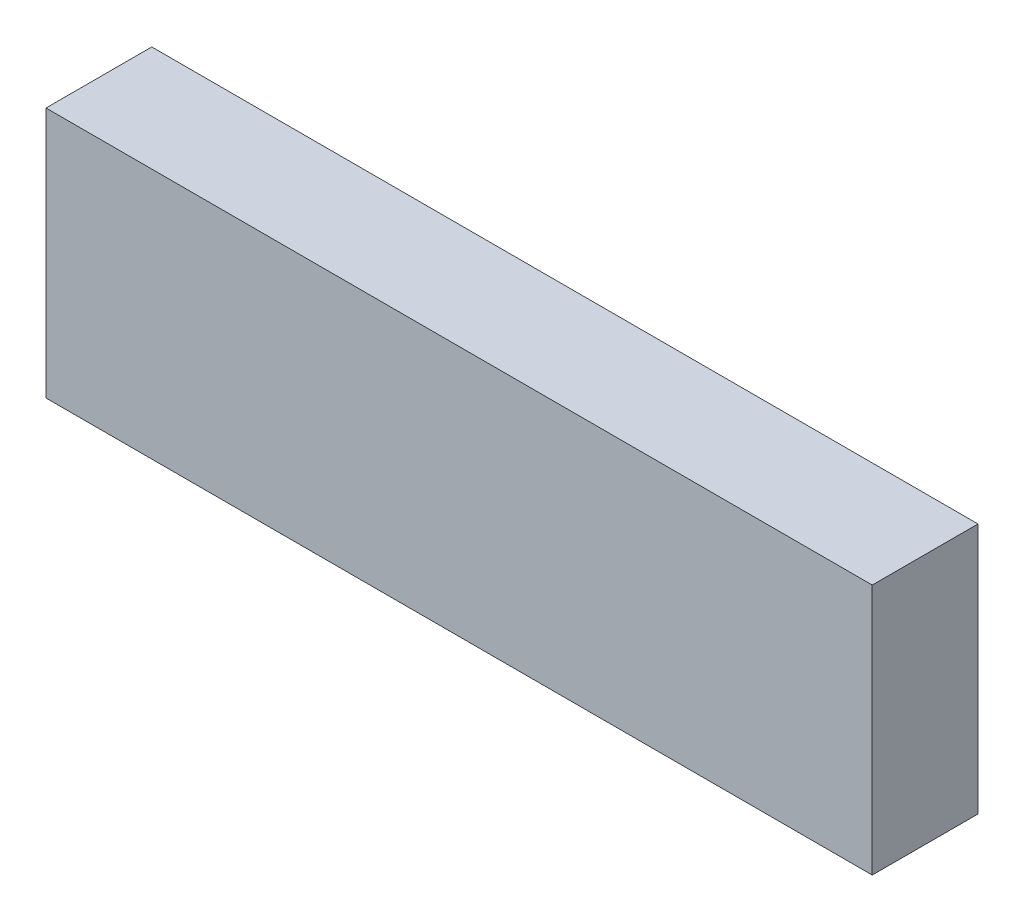
ISO-10303-21;
HEADER;
FILE_DESCRIPTION(('STEP AP214'),'2;1');
FILE_NAME('part.step','',(''),(''),'','','');
FILE_SCHEMA(('AUTOMOTIVE_DESIGN { 1 0 10303 214 1 1 1 1 }'));
ENDSEC;
DATA;
#1=APPLICATION_CONTEXT('core data for automotive mechanical design processes');
#2=APPLICATION_PROTOCOL_DEFINITION('international standard','automotive_design',2000,#1);
#3=PRODUCT_CONTEXT('',#1,'mechanical');
#4=PRODUCT('Part','Part','',(#3));
#5=PRODUCT_RELATED_PRODUCT_CATEGORY('part','',(#4));
#6=PRODUCT_DEFINITION_FORMATION('','',#4);
#7=PRODUCT_DEFINITION_CONTEXT('part definition',#1,'design');
#8=PRODUCT_DEFINITION('design','',#6,#7);
#9=PRODUCT_DEFINITION_SHAPE('','',#8);
#10=(LENGTH_UNIT() NAMED_UNIT(*) SI_UNIT(.MILLI.,.METRE.));
#11=(NAMED_UNIT(*) PLANE_ANGLE_UNIT() SI_UNIT($,.RADIAN.));
#12=(NAMED_UNIT(*) SI_UNIT($,.STERADIAN.) SOLID_ANGLE_UNIT());
#13=UNCERTAINTY_MEASURE_WITH_UNIT(LENGTH_MEASURE(1.E-05),#10,'distance_accuracy_value','');
#14=(GEOMETRIC_REPRESENTATION_CONTEXT(3) GLOBAL_UNCERTAINTY_ASSIGNED_CONTEXT((#13)) GLOBAL_UNIT_ASSIGNED_CONTEXT((#10,
#11,#12)) REPRESENTATION_CONTEXT('',''));
#15=CARTESIAN_POINT('',(0.,0.,0.));
#16=DIRECTION('',(0.,0.,1.));
#17=DIRECTION('',(1.,0.,0.));
#18=AXIS2_PLACEMENT_3D('',#15,#16,#17);
#19=CARTESIAN_POINT('',(-1.5625,0.,0.2));
#20=DIRECTION('',(0.,0.,1.));
#21=DIRECTION('',(1.,0.,0.));
#22=AXIS2_PLACEMENT_3D('',#19,#20,#21);
#23=PLANE('',#22);
#24=DIRECTION('',(0.,1.,0.));
#25=VECTOR('',#24,1.);
#26=CARTESIAN_POINT('',(0.,0.,0.2));
#27=LINE('',#26,#25);
#28=CARTESIAN_POINT('',(0.,0.475,0.2));
#29=VERTEX_POINT('',#28);
#30=CARTESIAN_POINT('',(0.,0.,0.2));
#31=VERTEX_POINT('',#30);
#32=EDGE_CURVE('E83',#29,#31,#27,.F.);
#33=ORIENTED_EDGE('',*,*,#32,.F.);
#34=DIRECTION('',(1.,0.,0.));
#35=VECTOR('',#34,1.);
#36=CARTESIAN_POINT('',(-1.5625,0.475,0.2));
#37=LINE('',#36,#35);
#38=CARTESIAN_POINT('',(-1.5625,0.475,0.2));
#39=VERTEX_POINT('',#38);
#40=EDGE_CURVE('E58',#39,#29,#37,.T.);
#41=ORIENTED_EDGE('',*,*,#40,.F.);
#42=DIRECTION('',(0.,1.,0.));
#43=VECTOR('',#42,1.);
#44=CARTESIAN_POINT('',(-1.5625,0.,0.2));
#45=LINE('',#44,#43);
#46=CARTESIAN_POINT('',(-1.5625,0.,0.2));
#47=VERTEX_POINT('',#46);
#48=EDGE_CURVE('E19',#39,#47,#45,.F.);
#49=ORIENTED_EDGE('',*,*,#48,.T.);
#50=DIRECTION('',(1.,0.,0.));
#51=VECTOR('',#50,1.);
#52=CARTESIAN_POINT('',(-1.5625,0.,0.2));
#53=LINE('',#52,#51);
#54=EDGE_CURVE('E55',#47,#31,#53,.T.);
#55=ORIENTED_EDGE('',*,*,#54,.T.);
#56=EDGE_LOOP('',(#33,#41,#49,#55));
#57=FACE_BOUND('',#56,.T.);
#58=ADVANCED_FACE('F16',(#57),#23,.T.);
#59=CARTESIAN_POINT('',(-1.5625,0.,0.));
#60=DIRECTION('',(1.,0.,0.));
#61=DIRECTION('',(0.,0.,-1.));
#62=AXIS2_PLACEMENT_3D('',#59,#60,#61);
#63=PLANE('',#62);
#64=DIRECTION('',(0.,0.,1.));
#65=VECTOR('',#64,1.);
#66=CARTESIAN_POINT('',(-1.5625,0.475,0.));
#67=LINE('',#66,#65);
#68=CARTESIAN_POINT('',(-1.5625,0.475,0.));
#69=VERTEX_POINT('',#68);
#70=EDGE_CURVE('E85',#69,#39,#67,.T.);
#71=ORIENTED_EDGE('',*,*,#70,.F.);
#72=DIRECTION('',(0.,1.,0.));
#73=VECTOR('',#72,1.);
#74=CARTESIAN_POINT('',(-1.5625,0.,0.));
#75=LINE('',#74,#73);
#76=CARTESIAN_POINT('',(-1.5625,0.,0.));
#77=VERTEX_POINT('',#76);
#78=EDGE_CURVE('E75',#69,#77,#75,.F.);
#79=ORIENTED_EDGE('',*,*,#78,.T.);
#80=DIRECTION('',(0.,0.,1.));
#81=VECTOR('',#80,1.);
#82=CARTESIAN_POINT('',(-1.5625,0.,0.));
#83=LINE('',#82,#81);
#84=EDGE_CURVE('E64',#77,#47,#83,.T.);
#85=ORIENTED_EDGE('',*,*,#84,.T.);
#86=ORIENTED_EDGE('',*,*,#48,.F.);
#87=EDGE_LOOP('',(#71,#79,#85,#86));
#88=FACE_BOUND('',#87,.T.);
#89=ADVANCED_FACE('F74',(#88),#63,.F.);
#90=CARTESIAN_POINT('',(-1.5625,0.,0.));
#91=DIRECTION('',(0.,1.,0.));
#92=DIRECTION('',(0.,0.,1.));
#93=AXIS2_PLACEMENT_3D('',#90,#91,#92);
#94=PLANE('',#93);
#95=ORIENTED_EDGE('',*,*,#54,.F.);
#96=ORIENTED_EDGE('',*,*,#84,.F.);
#97=DIRECTION('',(1.,0.,0.));
#98=VECTOR('',#97,1.);
#99=CARTESIAN_POINT('',(-1.5625,0.,0.));
#100=LINE('',#99,#98);
#101=CARTESIAN_POINT('',(0.,0.,0.));
#102=VERTEX_POINT('',#101);
#103=EDGE_CURVE('E94',#77,#102,#100,.T.);
#104=ORIENTED_EDGE('',*,*,#103,.T.);
#105=DIRECTION('',(0.,0.,-1.));
#106=VECTOR('',#105,1.);
#107=CARTESIAN_POINT('',(0.,0.,0.));
#108=LINE('',#107,#106);
#109=EDGE_CURVE('E70',#31,#102,#108,.T.);
#110=ORIENTED_EDGE('',*,*,#109,.F.);
#111=EDGE_LOOP('',(#95,#96,#104,#110));
#112=FACE_BOUND('',#111,.T.);
#113=ADVANCED_FACE('F67',(#112),#94,.F.);
#114=CARTESIAN_POINT('',(0.,0.,0.));
#115=DIRECTION('',(1.,0.,0.));
#116=DIRECTION('',(0.,0.,-1.));
#117=AXIS2_PLACEMENT_3D('',#114,#115,#116);
#118=PLANE('',#117);
#119=DIRECTION('',(0.,0.,1.));
#120=VECTOR('',#119,1.);
#121=CARTESIAN_POINT('',(0.,0.475,0.));
#122=LINE('',#121,#120);
#123=CARTESIAN_POINT('',(0.,0.475,0.));
#124=VERTEX_POINT('',#123);
#125=EDGE_CURVE('E34',#29,#124,#122,.F.);
#126=ORIENTED_EDGE('',*,*,#125,.F.);
#127=ORIENTED_EDGE('',*,*,#32,.T.);
#128=ORIENTED_EDGE('',*,*,#109,.T.);
#129=DIRECTION('',(0.,1.,0.));
#130=VECTOR('',#129,1.);
#131=CARTESIAN_POINT('',(0.,0.,0.));
#132=LINE('',#131,#130);
#133=EDGE_CURVE('E26',#102,#124,#132,.T.);
#134=ORIENTED_EDGE('',*,*,#133,.T.);
#135=EDGE_LOOP('',(#126,#127,#128,#134));
#136=FACE_BOUND('',#135,.T.);
#137=ADVANCED_FACE('F100',(#136),#118,.T.);
#138=CARTESIAN_POINT('',(-1.5625,0.475,0.));
#139=DIRECTION('',(0.,1.,0.));
#140=DIRECTION('',(0.,0.,1.));
#141=AXIS2_PLACEMENT_3D('',#138,#139,#140);
#142=PLANE('',#141);
#143=ORIENTED_EDGE('',*,*,#40,.T.);
#144=ORIENTED_EDGE('',*,*,#125,.T.);
#145=DIRECTION('',(1.,0.,0.));
#146=VECTOR('',#145,1.);
#147=CARTESIAN_POINT('',(-1.5625,0.475,0.));
#148=LINE('',#147,#146);
#149=EDGE_CURVE('E11',#124,#69,#148,.F.);
#150=ORIENTED_EDGE('',*,*,#149,.T.);
#151=ORIENTED_EDGE('',*,*,#70,.T.);
#152=EDGE_LOOP('',(#143,#144,#150,#151));
#153=FACE_BOUND('',#152,.T.);
#154=ADVANCED_FACE('F103',(#153),#142,.T.);
#155=CARTESIAN_POINT('',(-1.5625,0.,0.));
#156=DIRECTION('',(0.,0.,1.));
#157=DIRECTION('',(1.,0.,0.));
#158=AXIS2_PLACEMENT_3D('',#155,#156,#157);
#159=PLANE('',#158);
#160=ORIENTED_EDGE('',*,*,#133,.F.);
#161=ORIENTED_EDGE('',*,*,#103,.F.);
#162=ORIENTED_EDGE('',*,*,#78,.F.);
#163=ORIENTED_EDGE('',*,*,#149,.F.);
#164=EDGE_LOOP('',(#160,#161,#162,#163));
#165=FACE_BOUND('',#164,.T.);
#166=ADVANCED_FACE('F102',(#165),#159,.F.);
#167=CLOSED_SHELL('',(#58,#89,#113,#137,#154,#166));
#168=MANIFOLD_SOLID_BREP('B1',#167);
#169=ADVANCED_BREP_SHAPE_REPRESENTATION('',(#18,#168),#14);
#170=SHAPE_DEFINITION_REPRESENTATION(#9,#169);
ENDSEC;
END-ISO-10303-21;
